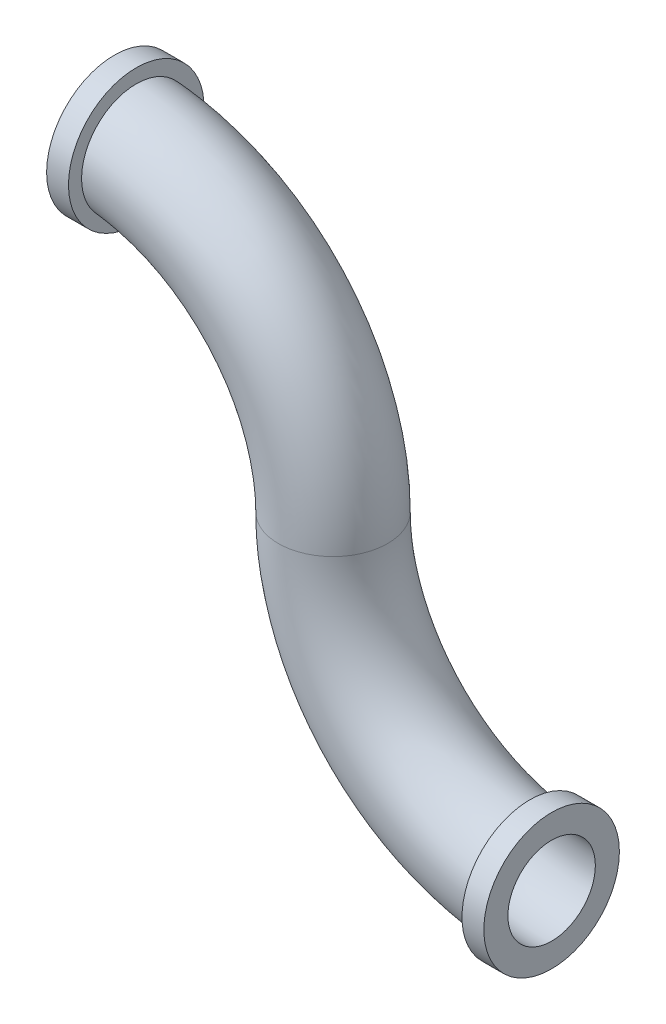
ISO-10303-21;
HEADER;
FILE_DESCRIPTION(('STEP AP214'),'2;1');
FILE_NAME('part.step','',(''),(''),'','','');
FILE_SCHEMA(('AUTOMOTIVE_DESIGN { 1 0 10303 214 1 1 1 1 }'));
ENDSEC;
DATA;
#1=APPLICATION_CONTEXT('core data for automotive mechanical design processes');
#2=APPLICATION_PROTOCOL_DEFINITION('international standard','automotive_design',2000,#1);
#3=PRODUCT_CONTEXT('',#1,'mechanical');
#4=PRODUCT('Part','Part','',(#3));
#5=PRODUCT_RELATED_PRODUCT_CATEGORY('part','',(#4));
#6=PRODUCT_DEFINITION_FORMATION('','',#4);
#7=PRODUCT_DEFINITION_CONTEXT('part definition',#1,'design');
#8=PRODUCT_DEFINITION('design','',#6,#7);
#9=PRODUCT_DEFINITION_SHAPE('','',#8);
#10=(LENGTH_UNIT() NAMED_UNIT(*) SI_UNIT(.MILLI.,.METRE.));
#11=(NAMED_UNIT(*) PLANE_ANGLE_UNIT() SI_UNIT($,.RADIAN.));
#12=(NAMED_UNIT(*) SI_UNIT($,.STERADIAN.) SOLID_ANGLE_UNIT());
#13=UNCERTAINTY_MEASURE_WITH_UNIT(LENGTH_MEASURE(1.E-05),#10,'distance_accuracy_value','');
#14=(GEOMETRIC_REPRESENTATION_CONTEXT(3) GLOBAL_UNCERTAINTY_ASSIGNED_CONTEXT((#13)) GLOBAL_UNIT_ASSIGNED_CONTEXT((#10,
#11,#12)) REPRESENTATION_CONTEXT('',''));
#15=CARTESIAN_POINT('',(0.,0.,0.));
#16=DIRECTION('',(0.,0.,1.));
#17=DIRECTION('',(1.,0.,0.));
#18=AXIS2_PLACEMENT_3D('',#15,#16,#17);
#19=CARTESIAN_POINT('',(1.,0.,0.));
#20=DIRECTION('',(0.,0.,1.));
#21=DIRECTION('',(1.,0.,0.));
#22=AXIS2_PLACEMENT_3D('',#19,#20,#21);
#23=TOROIDAL_SURFACE('',#22,1.,0.25);
#24=CARTESIAN_POINT('',(0.,0.,0.));
#25=DIRECTION('',(0.,1.,0.));
#26=DIRECTION('',(-1.,0.,0.));
#27=AXIS2_PLACEMENT_3D('',#24,#25,#26);
#28=CIRCLE('',#27,0.25);
#29=CARTESIAN_POINT('',(-0.25,0.,0.));
#30=VERTEX_POINT('',#29);
#31=EDGE_CURVE('E41',#30,#30,#28,.F.);
#32=ORIENTED_EDGE('',*,*,#31,.T.);
#33=EDGE_LOOP('',(#32));
#34=FACE_BOUND('',#33,.T.);
#35=CARTESIAN_POINT('',(0.900000000000001,-1.17098549054282,-0.178292636183616));
#36=CARTESIAN_POINT('',(0.900000000000001,-1.18100875760314,-0.168475423393496));
#37=CARTESIAN_POINT('',(0.900000000000001,-1.19021197301942,-0.157806668684189));
#38=CARTESIAN_POINT('',(0.900000000000001,-1.20670508806375,-0.135067300394562));
#39=CARTESIAN_POINT('',(0.900000000000001,-1.21399275207246,-0.122995072316738));
#40=CARTESIAN_POINT('',(0.900000000000001,-1.2264337163389,-0.0978008151949613));
#41=CARTESIAN_POINT('',(0.900000000000001,-1.23158779792181,-0.084679172554349));
#42=CARTESIAN_POINT('',(0.900000000000001,-1.23961421829034,-0.057759346550472));
#43=CARTESIAN_POINT('',(0.900000000000001,-1.24248711291599,-0.0439613288650645));
#44=CARTESIAN_POINT('',(0.900000000000001,-1.24586792328221,-0.0160999485330046));
#45=CARTESIAN_POINT('',(0.900000000000001,-1.24637945310533,-0.00203702447592011));
#46=CARTESIAN_POINT('',(0.900000000000001,-1.24503249206882,0.0259752969156451));
#47=CARTESIAN_POINT('',(0.900000000000001,-1.24317392780378,0.0399246907204553));
#48=CARTESIAN_POINT('',(0.900000000000001,-1.23714243900762,0.0673034722424064));
#49=CARTESIAN_POINT('',(0.900000000000001,-1.23297113377756,0.080733216769634));
#50=CARTESIAN_POINT('',(0.900000000000001,-1.22243532942205,0.106702785585052));
#51=CARTESIAN_POINT('',(0.900000000000001,-1.21607082997134,0.119242609741259));
#52=CARTESIAN_POINT('',(0.900000000000001,-1.20132351397512,0.143091162937981));
#53=CARTESIAN_POINT('',(0.900000000000001,-1.19293860782512,0.154398599682497));
#54=CARTESIAN_POINT('',(0.900000000000001,-1.17439400974421,0.175449806261136));
#55=CARTESIAN_POINT('',(0.900000000000001,-1.1642343019779,0.185193562142062));
#56=CARTESIAN_POINT('',(0.900000000000001,-1.142400807921,0.202868963945005));
#57=CARTESIAN_POINT('',(0.900000000000001,-1.13072313193231,0.210795804751663));
#58=CARTESIAN_POINT('',(0.900000000000001,-1.106206694839,0.224584917485912));
#59=CARTESIAN_POINT('',(0.900000000000001,-1.0933679113774,0.230447149649049));
#60=CARTESIAN_POINT('',(0.900000000000001,-1.06684241684044,0.239964438935739));
#61=CARTESIAN_POINT('',(0.900000000000001,-1.05315270655051,0.243611136621151));
#62=CARTESIAN_POINT('',(0.900000000000001,-1.02535632652833,0.248564420069221));
#63=CARTESIAN_POINT('',(0.900000000000001,-1.01124964746473,0.24987095342086));
#64=CARTESIAN_POINT('',(0.900000000000001,-0.982960242673602,0.25011129292686));
#65=CARTESIAN_POINT('',(0.900000000000001,-0.968777436788953,0.249035697836725));
#66=CARTESIAN_POINT('',(0.900000000000001,-0.940791978748754,0.244525145574541));
#67=CARTESIAN_POINT('',(0.900000000000001,-0.926989334384577,0.241090140083984));
#68=CARTESIAN_POINT('',(0.900000000000001,-0.900119500877165,0.231946105331132));
#69=CARTESIAN_POINT('',(0.900000000000001,-0.887054277013733,0.226231299315899));
#70=CARTESIAN_POINT('',(0.900000000000001,-0.862069524625154,0.212687591266642));
#71=CARTESIAN_POINT('',(0.900000000000001,-0.850150001432311,0.20485867939382));
#72=CARTESIAN_POINT('',(0.900000000000001,-0.827809385751461,0.187313043225065));
#73=CARTESIAN_POINT('',(0.900000000000001,-0.817386957162777,0.177598020654858));
#74=CARTESIAN_POINT('',(0.900000000000001,-0.798331800581926,0.156547556019966));
#75=CARTESIAN_POINT('',(0.900000000000001,-0.78969902569004,0.145212156432088));
#76=CARTESIAN_POINT('',(0.900000000000001,-0.774521549341065,0.12130735194327));
#77=CARTESIAN_POINT('',(0.900000000000001,-0.767965680896373,0.108745038618843));
#78=CARTESIAN_POINT('',(0.900000000000001,-0.75707547147019,0.0826917958473218));
#79=CARTESIAN_POINT('',(0.900000000000001,-0.75274101740764,0.0692009137086703));
#80=CARTESIAN_POINT('',(0.900000000000001,-0.7464515304126,0.0417884357391769));
#81=CARTESIAN_POINT('',(0.900000000000001,-0.744477870741135,0.0278711123530669));
#82=CARTESIAN_POINT('',(0.900000000000001,-0.742907965211834,-9.67777107270883E-05));
#83=CARTESIAN_POINT('',(0.900000000000001,-0.743311635792645,-0.0141473396878442));
#84=CARTESIAN_POINT('',(0.900000000000001,-0.74647595168463,-0.0419101300713308));
#85=CARTESIAN_POINT('',(0.900000000000001,-0.749225016976586,-0.0556236807545329));
#86=CARTESIAN_POINT('',(0.900000000000001,-0.756981504866823,-0.0823962086153956));
#87=CARTESIAN_POINT('',(0.900000000000001,-0.761988942042174,-0.0954551815673606));
#88=CARTESIAN_POINT('',(0.900000000000001,-0.774126705861386,-0.120581537676538));
#89=CARTESIAN_POINT('',(0.900000000000001,-0.781261720228275,-0.132646655350882));
#90=CARTESIAN_POINT('',(0.900000000000001,-0.797441901261908,-0.155419556737777));
#91=CARTESIAN_POINT('',(0.900000000000001,-0.806487143592179,-0.166127286657733));
#92=CARTESIAN_POINT('',(0.900000000000001,-0.826302199066213,-0.185966222471906));
#93=CARTESIAN_POINT('',(0.900000000000001,-0.837084271925134,-0.195085183140126));
#94=CARTESIAN_POINT('',(0.900000000000001,-0.860017328027748,-0.211398777282231));
#95=CARTESIAN_POINT('',(0.900000000000001,-0.872168367308181,-0.218593331942524));
#96=CARTESIAN_POINT('',(0.900000000000001,-0.897586821201383,-0.23090407067035));
#97=CARTESIAN_POINT('',(0.900000000000001,-0.910861457426391,-0.236005348116109));
#98=CARTESIAN_POINT('',(0.900000000000001,-0.938076874339729,-0.243914034217267));
#99=CARTESIAN_POINT('',(0.900000000000001,-0.95201764235762,-0.246721486484957));
#100=CARTESIAN_POINT('',(0.900000000000001,-0.980211648582923,-0.249967330461957));
#101=CARTESIAN_POINT('',(0.900000000000001,-0.994465645464104,-0.250399137344192));
#102=CARTESIAN_POINT('',(0.900000000000001,-1.02284738836589,-0.248860312728376));
#103=CARTESIAN_POINT('',(0.900000000000001,-1.03697510258974,-0.246889092432016));
#104=CARTESIAN_POINT('',(0.900000000000001,-1.06468469916975,-0.240599005426799));
#105=CARTESIAN_POINT('',(0.900000000000001,-1.07826701209187,-0.236282031317656));
#106=CARTESIAN_POINT('',(0.900000000000001,-1.10449774191692,-0.225422644159082));
#107=CARTESIAN_POINT('',(0.900000000000001,-1.11714727641918,-0.218882948753069));
#108=CARTESIAN_POINT('',(0.900000000000001,-1.13668216844624,-0.206585731557192));
#109=CARTESIAN_POINT('',(0.900000000000001,-1.14396136325801,-0.201442166980575));
#110=CARTESIAN_POINT('',(0.900000000000001,-1.15793230761086,-0.190410946981318));
#111=CARTESIAN_POINT('',(0.900000000000001,-1.16462405814971,-0.184523292822544));
#112=CARTESIAN_POINT('',(0.900000000000001,-1.17098549054282,-0.178292636183616));
#113=B_SPLINE_CURVE_WITH_KNOTS('',3,(#35,#36,#37,#38,#39,#40,#41,#42,#43,#44,#45,#46,#47,#48,
#49,#50,#51,#52,#53,#54,#55,#56,#57,#58,#59,#60,#61,#62,#63,#64,#65,#66,#67,#68,#69,#70,#71,#72,
#73,#74,#75,#76,#77,#78,#79,#80,#81,#82,#83,#84,#85,#86,#87,#88,#89,#90,#91,#92,#93,#94,#95,#96,
#97,#98,#99,#100,#101,#102,#103,#104,#105,#106,#107,#108,#109,#110,#111,#112),.UNSPECIFIED.,.T.,
.F.,(4,2,2,2,2,2,2,2,2,2,2,2,2,2,2,2,2,2,2,2,2,2,2,2,2,2,2,2,2,2,2,2,2,2,2,2,2,2,4),(0.,
0.0420578985794272,0.084164666693593,0.126256001495222,0.168337077061195,0.21035372589621,
0.252371676082182,0.294360243840177,0.336348817825516,0.378381006288444,0.420413569796481,
0.462556044347986,0.504699330521053,0.547000655778981,0.589302928418191,0.631772447462535,
0.67424283626865,0.716821530747927,0.759400423386807,0.801941076667363,0.844480614985313,
0.886787386784712,0.929092004744716,0.971060588646018,1.01302769739229,1.05478879133486,
1.09655015483585,1.13840422035458,1.18025994401072,1.22242522132604,1.26459222524596,
1.3070545045138,1.34951597643135,1.39209508421939,1.43468462698992,1.47723985860194,
1.51974324548614,1.54643603250214,1.57312877418),.UNSPECIFIED.);
#114=CARTESIAN_POINT('',(0.900000000000001,-1.17098549054282,-0.178292636183616));
#115=VERTEX_POINT('',#114);
#116=EDGE_CURVE('E34',#115,#115,#113,.T.);
#117=ORIENTED_EDGE('',*,*,#116,.T.);
#118=EDGE_LOOP('',(#117));
#119=FACE_BOUND('',#118,.T.);
#120=ADVANCED_FACE('F30',(#34,#119),#23,.T.);
#121=CARTESIAN_POINT('',(-1.,0.,0.));
#122=DIRECTION('',(0.,0.,1.));
#123=DIRECTION('',(1.,0.,0.));
#124=AXIS2_PLACEMENT_3D('',#121,#122,#123);
#125=TOROIDAL_SURFACE('',#124,1.,0.25);
#126=ORIENTED_EDGE('',*,*,#31,.F.);
#127=EDGE_LOOP('',(#126));
#128=FACE_BOUND('',#127,.T.);
#129=CARTESIAN_POINT('',(-0.900000000000007,0.798598903682384,-0.156239637939055));
#130=CARTESIAN_POINT('',(-0.900000000000007,0.789809384285255,-0.145344468335609));
#131=CARTESIAN_POINT('',(-0.900000000000007,0.78192827789053,-0.133703962300581));
#132=CARTESIAN_POINT('',(-0.900000000000007,0.76822209689242,-0.109257379143087));
#133=CARTESIAN_POINT('',(-0.900000000000007,0.762399309593995,-0.0964500251078343));
#134=CARTESIAN_POINT('',(-0.900000000000007,0.752992349834387,-0.0700386597896404));
#135=CARTESIAN_POINT('',(-0.900000000000007,0.749407805637635,-0.0564347812071179));
#136=CARTESIAN_POINT('',(-0.900000000000007,0.744586811600072,-0.028820646157335));
#137=CARTESIAN_POINT('',(-0.900000000000007,0.743349769534634,-0.0148104930902104));
#138=CARTESIAN_POINT('',(-0.900000000000007,0.743259870438664,0.0131538110387407));
#139=CARTESIAN_POINT('',(-0.900000000000007,0.744396238712349,0.0271079282969868));
#140=CARTESIAN_POINT('',(-0.900000000000007,0.748996827325868,0.0546272137432179));
#141=CARTESIAN_POINT('',(-0.900000000000007,0.752461117681838,0.0681923702197634));
#142=CARTESIAN_POINT('',(-0.900000000000007,0.761611366254962,0.0945453892648779));
#143=CARTESIAN_POINT('',(-0.900000000000007,0.767296512870582,0.107333533818286));
#144=CARTESIAN_POINT('',(-0.900000000000007,0.78072022693771,0.131782096781474));
#145=CARTESIAN_POINT('',(-0.900000000000007,0.788458852370729,0.143442483335477));
#146=CARTESIAN_POINT('',(-0.900000000000007,0.805819167393061,0.165383116436981));
#147=CARTESIAN_POINT('',(-0.900000000000007,0.815452210836544,0.175654378083549));
#148=CARTESIAN_POINT('',(-0.900000000000007,0.83629413509131,0.194449314988614));
#149=CARTESIAN_POINT('',(-0.900000000000007,0.847503079128376,0.202972920096664));
#150=CARTESIAN_POINT('',(-0.900000000000007,0.871272567822176,0.218098495866875));
#151=CARTESIAN_POINT('',(-0.900000000000007,0.88384288954099,0.224685104803622));
#152=CARTESIAN_POINT('',(-0.900000000000007,0.90990744170417,0.235665425768117));
#153=CARTESIAN_POINT('',(-0.900000000000007,0.923401698579907,0.240059075031189));
#154=CARTESIAN_POINT('',(-0.900000000000007,0.950996274516699,0.246545191192852));
#155=CARTESIAN_POINT('',(-0.900000000000007,0.965099030204136,0.248627297728038));
#156=CARTESIAN_POINT('',(-0.900000000000007,0.993454065031127,0.250394447161815));
#157=CARTESIAN_POINT('',(-0.900000000000007,1.00770634481024,0.250079479803207));
#158=CARTESIAN_POINT('',(-0.900000000000007,1.03595521616413,0.247058139402245));
#159=CARTESIAN_POINT('',(-0.900000000000007,1.04995181041844,0.244351791435899));
#160=CARTESIAN_POINT('',(-0.900000000000007,1.07728941354979,0.236620477359455));
#161=CARTESIAN_POINT('',(-0.900000000000007,1.09063043089042,0.231595541191429));
#162=CARTESIAN_POINT('',(-0.900000000000007,1.11623441348764,0.219384869006445));
#163=CARTESIAN_POINT('',(-0.900000000000007,1.12850052116936,0.212205722852413));
#164=CARTESIAN_POINT('',(-0.900000000000007,1.15164683911902,0.195882113872183));
#165=CARTESIAN_POINT('',(-0.900000000000007,1.16252707799712,0.186737691628038));
#166=CARTESIAN_POINT('',(-0.900000000000007,1.18254618043252,0.166782766405173));
#167=CARTESIAN_POINT('',(-0.900000000000007,1.19169188771539,0.155979129073376));
#168=CARTESIAN_POINT('',(-0.900000000000007,1.20803194260448,0.13298512264844));
#169=CARTESIAN_POINT('',(-0.900000000000007,1.21522632892052,0.120794781071202));
#170=CARTESIAN_POINT('',(-0.900000000000007,1.22743328712823,0.0954202629388033));
#171=CARTESIAN_POINT('',(-0.900000000000007,1.23245353062028,0.0822397766594047));
#172=CARTESIAN_POINT('',(-0.900000000000007,1.24020425316792,0.0552219448415186));
#173=CARTESIAN_POINT('',(-0.900000000000007,1.24293476523732,0.0413846087766626));
#174=CARTESIAN_POINT('',(-0.900000000000007,1.24602348072051,0.0134795739953021));
#175=CARTESIAN_POINT('',(-0.900000000000007,1.24638705742557,-0.000587530219673995));
#176=CARTESIAN_POINT('',(-0.900000000000007,1.24474572765085,-0.0285828177191347));
#177=CARTESIAN_POINT('',(-0.900000000000007,1.24274083539625,-0.0425110018374765));
#178=CARTESIAN_POINT('',(-0.900000000000007,1.23642242974538,-0.069824146498637));
#179=CARTESIAN_POINT('',(-0.900000000000007,1.23211036770417,-0.0832094428634812));
#180=CARTESIAN_POINT('',(-0.900000000000007,1.22130261383504,-0.109067212165588));
#181=CARTESIAN_POINT('',(-0.900000000000007,1.21480691921558,-0.121539683935883));
#182=CARTESIAN_POINT('',(-0.900000000000007,1.1998099911078,-0.145233133026622));
#183=CARTESIAN_POINT('',(-0.900000000000007,1.1913065812558,-0.156452732655625));
#184=CARTESIAN_POINT('',(-0.900000000000007,1.17254140277261,-0.177309784421282));
#185=CARTESIAN_POINT('',(-0.900000000000007,1.16227961187626,-0.18694721652102));
#186=CARTESIAN_POINT('',(-0.900000000000007,1.1402605361785,-0.204394588974111));
#187=CARTESIAN_POINT('',(-0.900000000000007,1.12849935085691,-0.212199606378335));
#188=CARTESIAN_POINT('',(-0.900000000000007,1.10383745451998,-0.225732886882564));
#189=CARTESIAN_POINT('',(-0.900000000000007,1.09093672012772,-0.231461107366438));
#190=CARTESIAN_POINT('',(-0.900000000000007,1.06430982270299,-0.240701650163389));
#191=CARTESIAN_POINT('',(-0.900000000000007,1.05058071487359,-0.244205486570355));
#192=CARTESIAN_POINT('',(-0.900000000000007,1.0227304868784,-0.248868281721869));
#193=CARTESIAN_POINT('',(-0.900000000000007,1.00860937300525,-0.250027278084741));
#194=CARTESIAN_POINT('',(-0.900000000000007,0.980317689668528,-0.249971637934856));
#195=CARTESIAN_POINT('',(-0.900000000000007,0.966147138161858,-0.248747884057992));
#196=CARTESIAN_POINT('',(-0.900000000000007,0.938207090362046,-0.243944388235435));
#197=CARTESIAN_POINT('',(-0.900000000000007,0.92443770161994,-0.240364020446176));
#198=CARTESIAN_POINT('',(-0.900000000000007,0.897654268254543,-0.230935097081438));
#199=CARTESIAN_POINT('',(-0.900000000000007,0.884642569313194,-0.225079887987268));
#200=CARTESIAN_POINT('',(-0.900000000000007,0.859799813124305,-0.211269182973));
#201=CARTESIAN_POINT('',(-0.900000000000007,0.847967374981076,-0.203316184310893));
#202=CARTESIAN_POINT('',(-0.900000000000007,0.829849441104617,-0.188776882063845));
#203=CARTESIAN_POINT('',(-0.900000000000007,0.823111383012066,-0.182745072414764));
#204=CARTESIAN_POINT('',(-0.900000000000007,0.810322395283978,-0.169992202553551));
#205=CARTESIAN_POINT('',(-0.900000000000007,0.804271466644268,-0.163271141342543));
#206=CARTESIAN_POINT('',(-0.900000000000007,0.798598903682384,-0.156239637939055));
#207=B_SPLINE_CURVE_WITH_KNOTS('',3,(#129,#130,#131,#132,#133,#134,#135,#136,#137,#138,#139,
#140,#141,#142,#143,#144,#145,#146,#147,#148,#149,#150,#151,#152,#153,#154,#155,#156,#157,#158,
#159,#160,#161,#162,#163,#164,#165,#166,#167,#168,#169,#170,#171,#172,#173,#174,#175,#176,#177,
#178,#179,#180,#181,#182,#183,#184,#185,#186,#187,#188,#189,#190,#191,#192,#193,#194,#195,#196,
#197,#198,#199,#200,#201,#202,#203,#204,#205,#206),.UNSPECIFIED.,.T.,.F.,(4,2,2,2,2,2,2,2,2,2,2,
2,2,2,2,2,2,2,2,2,2,2,2,2,2,2,2,2,2,2,2,2,2,2,2,2,2,2,4),(0.,0.0419631052503927,
0.0839726964411999,0.125975308668973,0.167967323125762,0.209769118662524,0.251572171514233,
0.293359961905662,0.335148932332196,0.377196440897468,0.419245636907758,0.461619835954524,
0.503995247723258,0.54655982933734,0.589124593087473,0.631688910508933,0.6742526782734,
0.716687545691694,0.759121536933535,0.801384450217336,0.843646525038763,0.88575823574167,
0.927869339259047,0.969884810944664,1.01190003028372,1.05388885042508,1.09587772424463,
1.13791232469054,1.17994745743075,1.22209426111071,1.26424192959939,1.30654943795309,
1.34885626756105,1.39132529833847,1.43380561212635,1.47641112039157,1.51896613717817,
1.5460481653165,1.57313023270311),.UNSPECIFIED.);
#208=CARTESIAN_POINT('',(-0.900000000000007,0.798598903682384,-0.156239637939055));
#209=VERTEX_POINT('',#208);
#210=EDGE_CURVE('E10',#209,#209,#207,.T.);
#211=ORIENTED_EDGE('',*,*,#210,.F.);
#212=EDGE_LOOP('',(#211));
#213=FACE_BOUND('',#212,.T.);
#214=ADVANCED_FACE('F51',(#128,#213),#125,.T.);
#215=CARTESIAN_POINT('',(-1.00000000000001,0.999999999999992,0.));
#216=DIRECTION('',(1.,0.,0.));
#217=DIRECTION('',(0.,0.,-1.));
#218=AXIS2_PLACEMENT_3D('',#215,#216,#217);
#219=PLANE('',#218);
#220=CARTESIAN_POINT('',(-1.00000000000001,0.999999999999992,0.));
#221=DIRECTION('',(1.,0.,0.));
#222=DIRECTION('',(0.,0.,-1.));
#223=AXIS2_PLACEMENT_3D('',#220,#221,#222);
#224=CIRCLE('',#223,0.2);
#225=CARTESIAN_POINT('',(-1.00000000000001,1.19999999999999,0.));
#226=VERTEX_POINT('',#225);
#227=EDGE_CURVE('E45',#226,#226,#224,.T.);
#228=ORIENTED_EDGE('',*,*,#227,.T.);
#229=EDGE_LOOP('',(#228));
#230=FACE_BOUND('',#229,.T.);
#231=CARTESIAN_POINT('',(-1.00000000000001,0.999999999999992,0.));
#232=DIRECTION('',(-1.,0.,0.));
#233=DIRECTION('',(0.,0.,1.));
#234=AXIS2_PLACEMENT_3D('',#231,#232,#233);
#235=CIRCLE('',#234,0.31);
#236=CARTESIAN_POINT('',(-1.00000000000001,0.999999999999992,0.31));
#237=VERTEX_POINT('',#236);
#238=EDGE_CURVE('E94',#237,#237,#235,.T.);
#239=ORIENTED_EDGE('',*,*,#238,.T.);
#240=EDGE_LOOP('',(#239));
#241=FACE_BOUND('',#240,.T.);
#242=ADVANCED_FACE('F75',(#230,#241),#219,.F.);
#243=CARTESIAN_POINT('',(1.,-1.,0.));
#244=DIRECTION('',(1.,0.,0.));
#245=DIRECTION('',(0.,0.,-1.));
#246=AXIS2_PLACEMENT_3D('',#243,#244,#245);
#247=PLANE('',#246);
#248=CARTESIAN_POINT('',(1.,-1.,0.));
#249=DIRECTION('',(1.,0.,0.));
#250=DIRECTION('',(0.,0.,-1.));
#251=AXIS2_PLACEMENT_3D('',#248,#249,#250);
#252=CIRCLE('',#251,0.2);
#253=CARTESIAN_POINT('',(1.,-1.,-0.2));
#254=VERTEX_POINT('',#253);
#255=EDGE_CURVE('E108',#254,#254,#252,.T.);
#256=ORIENTED_EDGE('',*,*,#255,.F.);
#257=EDGE_LOOP('',(#256));
#258=FACE_BOUND('',#257,.T.);
#259=CARTESIAN_POINT('',(1.,-1.,0.));
#260=DIRECTION('',(1.,0.,0.));
#261=DIRECTION('',(0.,0.,-1.));
#262=AXIS2_PLACEMENT_3D('',#259,#260,#261);
#263=CIRCLE('',#262,0.31);
#264=CARTESIAN_POINT('',(1.,-1.,-0.31));
#265=VERTEX_POINT('',#264);
#266=EDGE_CURVE('E100',#265,#265,#263,.T.);
#267=ORIENTED_EDGE('',*,*,#266,.T.);
#268=EDGE_LOOP('',(#267));
#269=FACE_BOUND('',#268,.T.);
#270=ADVANCED_FACE('F72',(#258,#269),#247,.T.);
#271=CARTESIAN_POINT('',(-1.,0.,0.));
#272=DIRECTION('',(0.,0.,1.));
#273=DIRECTION('',(1.,0.,0.));
#274=AXIS2_PLACEMENT_3D('',#271,#272,#273);
#275=TOROIDAL_SURFACE('',#274,1.,0.2);
#276=CARTESIAN_POINT('',(0.,0.,0.));
#277=DIRECTION('',(0.,-1.,0.));
#278=DIRECTION('',(0.,0.,-1.));
#279=AXIS2_PLACEMENT_3D('',#276,#277,#278);
#280=CIRCLE('',#279,0.2);
#281=CARTESIAN_POINT('',(0.2,0.,0.));
#282=VERTEX_POINT('',#281);
#283=EDGE_CURVE('E112',#282,#282,#280,.T.);
#284=CARTESIAN_POINT('',(-1.,0.,0.));
#285=DIRECTION('',(0.,0.,1.));
#286=DIRECTION('',(1.,0.,0.));
#287=AXIS2_PLACEMENT_3D('',#284,#285,#286);
#288=CIRCLE('',#287,1.2);
#289=EDGE_CURVE('',#282,#226,#288,.T.);
#290=ORIENTED_EDGE('',*,*,#283,.T.);
#291=ORIENTED_EDGE('',*,*,#227,.F.);
#292=ORIENTED_EDGE('',*,*,#289,.T.);
#293=ORIENTED_EDGE('',*,*,#289,.F.);
#294=EDGE_LOOP('',(#290,#292,#291,#293));
#295=FACE_BOUND('',#294,.T.);
#296=ADVANCED_FACE('F68',(#295),#275,.F.);
#297=CARTESIAN_POINT('',(1.,0.,0.));
#298=DIRECTION('',(0.,0.,1.));
#299=DIRECTION('',(1.,0.,0.));
#300=AXIS2_PLACEMENT_3D('',#297,#298,#299);
#301=TOROIDAL_SURFACE('',#300,1.,0.2);
#302=ORIENTED_EDGE('',*,*,#283,.F.);
#303=EDGE_LOOP('',(#302));
#304=FACE_BOUND('',#303,.T.);
#305=ORIENTED_EDGE('',*,*,#255,.T.);
#306=EDGE_LOOP('',(#305));
#307=FACE_BOUND('',#306,.T.);
#308=ADVANCED_FACE('F60',(#304,#307),#301,.F.);
#309=CARTESIAN_POINT('',(-0.900000000000007,0.999999999999992,0.));
#310=DIRECTION('',(-1.,0.,0.));
#311=DIRECTION('',(0.,0.,1.));
#312=AXIS2_PLACEMENT_3D('',#309,#310,#311);
#313=PLANE('',#312);
#314=CARTESIAN_POINT('',(-0.900000000000007,0.999999999999992,0.));
#315=DIRECTION('',(-1.,0.,0.));
#316=DIRECTION('',(0.,0.,1.));
#317=AXIS2_PLACEMENT_3D('',#314,#315,#316);
#318=CIRCLE('',#317,0.31);
#319=CARTESIAN_POINT('',(-0.900000000000007,0.999999999999992,0.31));
#320=VERTEX_POINT('',#319);
#321=EDGE_CURVE('E97',#320,#320,#318,.T.);
#322=ORIENTED_EDGE('',*,*,#321,.F.);
#323=EDGE_LOOP('',(#322));
#324=FACE_BOUND('',#323,.T.);
#325=ORIENTED_EDGE('',*,*,#210,.T.);
#326=EDGE_LOOP('',(#325));
#327=FACE_BOUND('',#326,.T.);
#328=ADVANCED_FACE('F54',(#324,#327),#313,.F.);
#329=CARTESIAN_POINT('',(-0.900000000000007,0.999999999999992,0.));
#330=DIRECTION('',(-1.,0.,0.));
#331=DIRECTION('',(0.,0.,1.));
#332=AXIS2_PLACEMENT_3D('',#329,#330,#331);
#333=CYLINDRICAL_SURFACE('',#332,0.31);
#334=ORIENTED_EDGE('',*,*,#321,.T.);
#335=EDGE_LOOP('',(#334));
#336=FACE_BOUND('',#335,.T.);
#337=ORIENTED_EDGE('',*,*,#238,.F.);
#338=EDGE_LOOP('',(#337));
#339=FACE_BOUND('',#338,.T.);
#340=ADVANCED_FACE('F59',(#336,#339),#333,.T.);
#341=CARTESIAN_POINT('',(0.900000000000001,-1.,0.));
#342=DIRECTION('',(1.,0.,0.));
#343=DIRECTION('',(0.,0.,-1.));
#344=AXIS2_PLACEMENT_3D('',#341,#342,#343);
#345=CYLINDRICAL_SURFACE('',#344,0.31);
#346=CARTESIAN_POINT('',(0.900000000000001,-1.,0.));
#347=DIRECTION('',(1.,0.,0.));
#348=DIRECTION('',(0.,0.,-1.));
#349=AXIS2_PLACEMENT_3D('',#346,#347,#348);
#350=CIRCLE('',#349,0.31);
#351=CARTESIAN_POINT('',(0.900000000000001,-1.,-0.31));
#352=VERTEX_POINT('',#351);
#353=EDGE_CURVE('E95',#352,#352,#350,.T.);
#354=ORIENTED_EDGE('',*,*,#353,.T.);
#355=EDGE_LOOP('',(#354));
#356=FACE_BOUND('',#355,.T.);
#357=ORIENTED_EDGE('',*,*,#266,.F.);
#358=EDGE_LOOP('',(#357));
#359=FACE_BOUND('',#358,.T.);
#360=ADVANCED_FACE('F62',(#356,#359),#345,.T.);
#361=CARTESIAN_POINT('',(0.900000000000001,-1.,0.));
#362=DIRECTION('',(1.,0.,0.));
#363=DIRECTION('',(0.,0.,-1.));
#364=AXIS2_PLACEMENT_3D('',#361,#362,#363);
#365=PLANE('',#364);
#366=ORIENTED_EDGE('',*,*,#116,.F.);
#367=EDGE_LOOP('',(#366));
#368=FACE_BOUND('',#367,.T.);
#369=ORIENTED_EDGE('',*,*,#353,.F.);
#370=EDGE_LOOP('',(#369));
#371=FACE_BOUND('',#370,.T.);
#372=ADVANCED_FACE('F123',(#368,#371),#365,.F.);
#373=CLOSED_SHELL('',(#120,#214,#242,#270,#296,#308,#328,#340,#360,#372));
#374=MANIFOLD_SOLID_BREP('B2',#373);
#375=ADVANCED_BREP_SHAPE_REPRESENTATION('',(#18,#374),#14);
#376=SHAPE_DEFINITION_REPRESENTATION(#9,#375);
ENDSEC;
END-ISO-10303-21;
